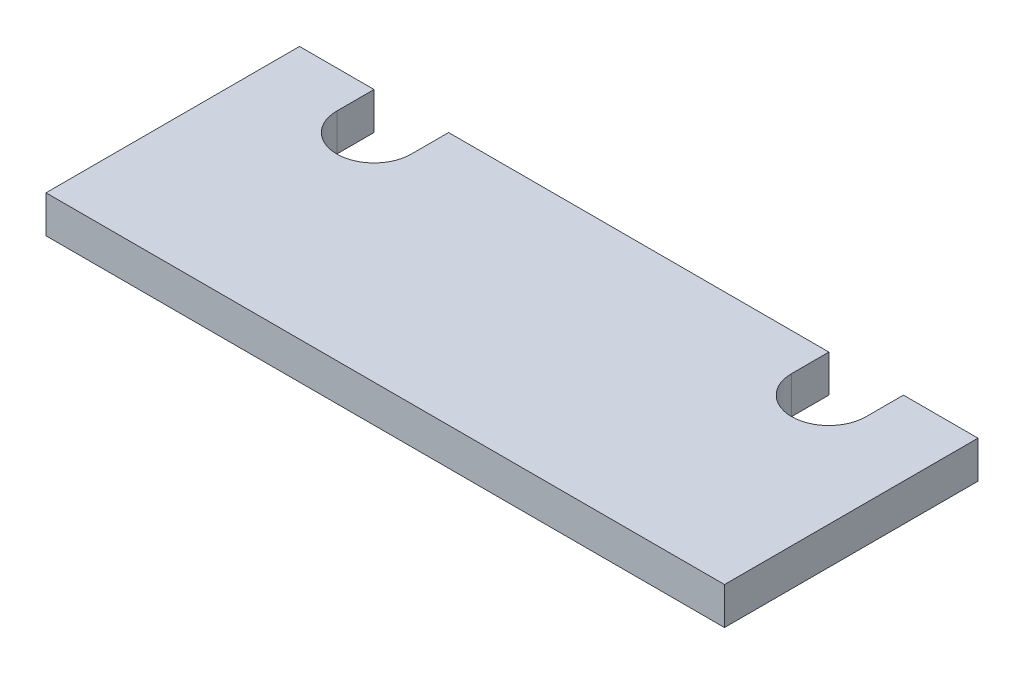
ISO-10303-21;
HEADER;
FILE_DESCRIPTION(('STEP AP214'),'2;1');
FILE_NAME('part.step','',(''),(''),'','','');
FILE_SCHEMA(('AUTOMOTIVE_DESIGN { 1 0 10303 214 1 1 1 1 }'));
ENDSEC;
DATA;
#1=APPLICATION_CONTEXT('core data for automotive mechanical design processes');
#2=APPLICATION_PROTOCOL_DEFINITION('international standard','automotive_design',2000,#1);
#3=PRODUCT_CONTEXT('',#1,'mechanical');
#4=PRODUCT('Part','Part','',(#3));
#5=PRODUCT_RELATED_PRODUCT_CATEGORY('part','',(#4));
#6=PRODUCT_DEFINITION_FORMATION('','',#4);
#7=PRODUCT_DEFINITION_CONTEXT('part definition',#1,'design');
#8=PRODUCT_DEFINITION('design','',#6,#7);
#9=PRODUCT_DEFINITION_SHAPE('','',#8);
#10=(LENGTH_UNIT() NAMED_UNIT(*) SI_UNIT(.MILLI.,.METRE.));
#11=(NAMED_UNIT(*) PLANE_ANGLE_UNIT() SI_UNIT($,.RADIAN.));
#12=(NAMED_UNIT(*) SI_UNIT($,.STERADIAN.) SOLID_ANGLE_UNIT());
#13=UNCERTAINTY_MEASURE_WITH_UNIT(LENGTH_MEASURE(1.E-05),#10,'distance_accuracy_value','');
#14=(GEOMETRIC_REPRESENTATION_CONTEXT(3) GLOBAL_UNCERTAINTY_ASSIGNED_CONTEXT((#13)) GLOBAL_UNIT_ASSIGNED_CONTEXT((#10,
#11,#12)) REPRESENTATION_CONTEXT('',''));
#15=CARTESIAN_POINT('',(0.,0.,0.));
#16=DIRECTION('',(0.,0.,1.));
#17=DIRECTION('',(1.,0.,0.));
#18=AXIS2_PLACEMENT_3D('',#15,#16,#17);
#19=CARTESIAN_POINT('',(0.,6.35,-43.18));
#20=DIRECTION('',(0.,0.,1.));
#21=DIRECTION('',(1.,0.,0.));
#22=AXIS2_PLACEMENT_3D('',#19,#20,#21);
#23=PLANE('',#22);
#24=DIRECTION('',(-1.,0.,0.));
#25=VECTOR('',#24,1.);
#26=CARTESIAN_POINT('',(0.,6.35,-43.18));
#27=LINE('',#26,#25);
#28=CARTESIAN_POINT('',(90.17,6.35,-43.18));
#29=VERTEX_POINT('',#28);
#30=CARTESIAN_POINT('',(25.4,6.35,-43.18));
#31=VERTEX_POINT('',#30);
#32=EDGE_CURVE('E192',#29,#31,#27,.T.);
#33=ORIENTED_EDGE('',*,*,#32,.F.);
#34=DIRECTION('',(0.,-1.,0.));
#35=VECTOR('',#34,1.);
#36=CARTESIAN_POINT('',(90.17,6.35,-43.18));
#37=LINE('',#36,#35);
#38=CARTESIAN_POINT('',(90.17,0.,-43.18));
#39=VERTEX_POINT('',#38);
#40=EDGE_CURVE('E152',#29,#39,#37,.T.);
#41=ORIENTED_EDGE('',*,*,#40,.T.);
#42=DIRECTION('',(-1.,0.,0.));
#43=VECTOR('',#42,1.);
#44=CARTESIAN_POINT('',(0.,0.,-43.18));
#45=LINE('',#44,#43);
#46=CARTESIAN_POINT('',(25.4,0.,-43.18));
#47=VERTEX_POINT('',#46);
#48=EDGE_CURVE('E57',#39,#47,#45,.T.);
#49=ORIENTED_EDGE('',*,*,#48,.T.);
#50=DIRECTION('',(0.,1.,0.));
#51=VECTOR('',#50,1.);
#52=CARTESIAN_POINT('',(25.4,6.35,-43.18));
#53=LINE('',#52,#51);
#54=EDGE_CURVE('E172',#47,#31,#53,.T.);
#55=ORIENTED_EDGE('',*,*,#54,.T.);
#56=EDGE_LOOP('',(#33,#41,#49,#55));
#57=FACE_BOUND('',#56,.T.);
#58=ADVANCED_FACE('F34',(#57),#23,.F.);
#59=CARTESIAN_POINT('',(12.7,6.35,-43.18));
#60=VERTEX_POINT('',#59);
#61=CARTESIAN_POINT('',(0.,6.35,-43.18));
#62=VERTEX_POINT('',#61);
#63=EDGE_CURVE('E187',#60,#62,#27,.T.);
#64=ORIENTED_EDGE('',*,*,#63,.F.);
#65=DIRECTION('',(0.,-1.,0.));
#66=VECTOR('',#65,1.);
#67=CARTESIAN_POINT('',(12.7,6.35,-43.18));
#68=LINE('',#67,#66);
#69=CARTESIAN_POINT('',(12.7,0.,-43.18));
#70=VERTEX_POINT('',#69);
#71=EDGE_CURVE('E175',#60,#70,#68,.T.);
#72=ORIENTED_EDGE('',*,*,#71,.T.);
#73=CARTESIAN_POINT('',(0.,0.,-43.18));
#74=VERTEX_POINT('',#73);
#75=EDGE_CURVE('E199',#70,#74,#45,.T.);
#76=ORIENTED_EDGE('',*,*,#75,.T.);
#77=DIRECTION('',(0.,-1.,0.));
#78=VECTOR('',#77,1.);
#79=CARTESIAN_POINT('',(0.,6.35,-43.18));
#80=LINE('',#79,#78);
#81=EDGE_CURVE('E191',#62,#74,#80,.T.);
#82=ORIENTED_EDGE('',*,*,#81,.F.);
#83=EDGE_LOOP('',(#64,#72,#76,#82));
#84=FACE_BOUND('',#83,.T.);
#85=ADVANCED_FACE('F219',(#84),#23,.F.);
#86=CARTESIAN_POINT('',(0.,6.35,0.));
#87=DIRECTION('',(1.,0.,0.));
#88=DIRECTION('',(0.,0.,-1.));
#89=AXIS2_PLACEMENT_3D('',#86,#87,#88);
#90=PLANE('',#89);
#91=DIRECTION('',(0.,0.,1.));
#92=VECTOR('',#91,1.);
#93=CARTESIAN_POINT('',(0.,0.,0.));
#94=LINE('',#93,#92);
#95=CARTESIAN_POINT('',(0.,0.,0.));
#96=VERTEX_POINT('',#95);
#97=EDGE_CURVE('E178',#74,#96,#94,.T.);
#98=ORIENTED_EDGE('',*,*,#97,.T.);
#99=DIRECTION('',(0.,-1.,0.));
#100=VECTOR('',#99,1.);
#101=CARTESIAN_POINT('',(0.,6.35,0.));
#102=LINE('',#101,#100);
#103=CARTESIAN_POINT('',(0.,6.35,0.));
#104=VERTEX_POINT('',#103);
#105=EDGE_CURVE('E209',#104,#96,#102,.T.);
#106=ORIENTED_EDGE('',*,*,#105,.F.);
#107=DIRECTION('',(0.,0.,1.));
#108=VECTOR('',#107,1.);
#109=CARTESIAN_POINT('',(0.,6.35,0.));
#110=LINE('',#109,#108);
#111=EDGE_CURVE('E179',#62,#104,#110,.T.);
#112=ORIENTED_EDGE('',*,*,#111,.F.);
#113=ORIENTED_EDGE('',*,*,#81,.T.);
#114=EDGE_LOOP('',(#98,#106,#112,#113));
#115=FACE_BOUND('',#114,.T.);
#116=ADVANCED_FACE('F36',(#115),#90,.F.);
#117=CARTESIAN_POINT('',(0.,6.35,0.));
#118=DIRECTION('',(0.,0.,-1.));
#119=DIRECTION('',(-1.,0.,0.));
#120=AXIS2_PLACEMENT_3D('',#117,#118,#119);
#121=PLANE('',#120);
#122=DIRECTION('',(1.,0.,0.));
#123=VECTOR('',#122,1.);
#124=CARTESIAN_POINT('',(0.,0.,0.));
#125=LINE('',#124,#123);
#126=CARTESIAN_POINT('',(115.57,0.,0.));
#127=VERTEX_POINT('',#126);
#128=EDGE_CURVE('E195',#96,#127,#125,.T.);
#129=ORIENTED_EDGE('',*,*,#128,.T.);
#130=DIRECTION('',(0.,-1.,0.));
#131=VECTOR('',#130,1.);
#132=CARTESIAN_POINT('',(115.57,6.35,0.));
#133=LINE('',#132,#131);
#134=CARTESIAN_POINT('',(115.57,6.35,0.));
#135=VERTEX_POINT('',#134);
#136=EDGE_CURVE('E206',#135,#127,#133,.T.);
#137=ORIENTED_EDGE('',*,*,#136,.F.);
#138=DIRECTION('',(1.,0.,0.));
#139=VECTOR('',#138,1.);
#140=CARTESIAN_POINT('',(0.,6.35,0.));
#141=LINE('',#140,#139);
#142=EDGE_CURVE('E182',#104,#135,#141,.T.);
#143=ORIENTED_EDGE('',*,*,#142,.F.);
#144=ORIENTED_EDGE('',*,*,#105,.T.);
#145=EDGE_LOOP('',(#129,#137,#143,#144));
#146=FACE_BOUND('',#145,.T.);
#147=ADVANCED_FACE('F252',(#146),#121,.F.);
#148=CARTESIAN_POINT('',(115.57,6.35,0.));
#149=DIRECTION('',(-1.,0.,0.));
#150=DIRECTION('',(0.,0.,1.));
#151=AXIS2_PLACEMENT_3D('',#148,#149,#150);
#152=PLANE('',#151);
#153=DIRECTION('',(0.,0.,-1.));
#154=VECTOR('',#153,1.);
#155=CARTESIAN_POINT('',(115.57,0.,0.));
#156=LINE('',#155,#154);
#157=CARTESIAN_POINT('',(115.57,0.,-43.18));
#158=VERTEX_POINT('',#157);
#159=EDGE_CURVE('E197',#127,#158,#156,.T.);
#160=ORIENTED_EDGE('',*,*,#159,.T.);
#161=DIRECTION('',(0.,-1.,0.));
#162=VECTOR('',#161,1.);
#163=CARTESIAN_POINT('',(115.57,6.35,-43.18));
#164=LINE('',#163,#162);
#165=CARTESIAN_POINT('',(115.57,6.35,-43.18));
#166=VERTEX_POINT('',#165);
#167=EDGE_CURVE('E203',#166,#158,#164,.T.);
#168=ORIENTED_EDGE('',*,*,#167,.F.);
#169=DIRECTION('',(0.,0.,-1.));
#170=VECTOR('',#169,1.);
#171=CARTESIAN_POINT('',(115.57,6.35,0.));
#172=LINE('',#171,#170);
#173=EDGE_CURVE('E185',#135,#166,#172,.T.);
#174=ORIENTED_EDGE('',*,*,#173,.F.);
#175=ORIENTED_EDGE('',*,*,#136,.T.);
#176=EDGE_LOOP('',(#160,#168,#174,#175));
#177=FACE_BOUND('',#176,.T.);
#178=ADVANCED_FACE('F245',(#177),#152,.F.);
#179=CARTESIAN_POINT('',(102.87,0.,-43.18));
#180=VERTEX_POINT('',#179);
#181=EDGE_CURVE('E183',#158,#180,#45,.T.);
#182=ORIENTED_EDGE('',*,*,#181,.T.);
#183=DIRECTION('',(0.,1.,0.));
#184=VECTOR('',#183,1.);
#185=CARTESIAN_POINT('',(102.87,6.35,-43.18));
#186=LINE('',#185,#184);
#187=CARTESIAN_POINT('',(102.87,6.35,-43.18));
#188=VERTEX_POINT('',#187);
#189=EDGE_CURVE('E49',#180,#188,#186,.T.);
#190=ORIENTED_EDGE('',*,*,#189,.T.);
#191=EDGE_CURVE('E188',#166,#188,#27,.T.);
#192=ORIENTED_EDGE('',*,*,#191,.F.);
#193=ORIENTED_EDGE('',*,*,#167,.T.);
#194=EDGE_LOOP('',(#182,#190,#192,#193));
#195=FACE_BOUND('',#194,.T.);
#196=ADVANCED_FACE('F238',(#195),#23,.F.);
#197=CARTESIAN_POINT('',(0.,6.35,0.));
#198=DIRECTION('',(0.,-1.,0.));
#199=DIRECTION('',(0.,0.,-1.));
#200=AXIS2_PLACEMENT_3D('',#197,#198,#199);
#201=PLANE('',#200);
#202=CARTESIAN_POINT('',(96.52,6.35,-36.83));
#203=DIRECTION('',(0.,1.,0.));
#204=DIRECTION('',(0.,0.,-1.));
#205=AXIS2_PLACEMENT_3D('',#202,#203,#204);
#206=CIRCLE('',#205,6.35);
#207=CARTESIAN_POINT('',(90.17,6.35,-36.83));
#208=VERTEX_POINT('',#207);
#209=CARTESIAN_POINT('',(102.87,6.35,-36.83));
#210=VERTEX_POINT('',#209);
#211=EDGE_CURVE('E132',#208,#210,#206,.T.);
#212=ORIENTED_EDGE('',*,*,#211,.F.);
#213=DIRECTION('',(0.,0.,1.));
#214=VECTOR('',#213,1.);
#215=CARTESIAN_POINT('',(90.17,6.35,-52.705));
#216=LINE('',#215,#214);
#217=EDGE_CURVE('E143',#29,#208,#216,.T.);
#218=ORIENTED_EDGE('',*,*,#217,.F.);
#219=ORIENTED_EDGE('',*,*,#32,.T.);
#220=DIRECTION('',(0.,0.,-1.));
#221=VECTOR('',#220,1.);
#222=CARTESIAN_POINT('',(25.4,6.35,-52.705));
#223=LINE('',#222,#221);
#224=CARTESIAN_POINT('',(25.4,6.35,-36.83));
#225=VERTEX_POINT('',#224);
#226=EDGE_CURVE('E165',#225,#31,#223,.T.);
#227=ORIENTED_EDGE('',*,*,#226,.F.);
#228=CARTESIAN_POINT('',(19.05,6.35,-36.83));
#229=DIRECTION('',(0.,1.,0.));
#230=DIRECTION('',(0.,0.,1.));
#231=AXIS2_PLACEMENT_3D('',#228,#229,#230);
#232=CIRCLE('',#231,6.35);
#233=CARTESIAN_POINT('',(12.7,6.35,-36.83));
#234=VERTEX_POINT('',#233);
#235=EDGE_CURVE('E154',#234,#225,#232,.T.);
#236=ORIENTED_EDGE('',*,*,#235,.F.);
#237=DIRECTION('',(0.,0.,1.));
#238=VECTOR('',#237,1.);
#239=CARTESIAN_POINT('',(12.7,6.35,-52.705));
#240=LINE('',#239,#238);
#241=EDGE_CURVE('E159',#60,#234,#240,.T.);
#242=ORIENTED_EDGE('',*,*,#241,.F.);
#243=ORIENTED_EDGE('',*,*,#63,.T.);
#244=ORIENTED_EDGE('',*,*,#111,.T.);
#245=ORIENTED_EDGE('',*,*,#142,.T.);
#246=ORIENTED_EDGE('',*,*,#173,.T.);
#247=ORIENTED_EDGE('',*,*,#191,.T.);
#248=DIRECTION('',(0.,0.,-1.));
#249=VECTOR('',#248,1.);
#250=CARTESIAN_POINT('',(102.87,6.35,-52.705));
#251=LINE('',#250,#249);
#252=EDGE_CURVE('E145',#210,#188,#251,.T.);
#253=ORIENTED_EDGE('',*,*,#252,.F.);
#254=EDGE_LOOP('',(#212,#218,#219,#227,#236,#242,#243,#244,#245,#246,#247,#253));
#255=FACE_BOUND('',#254,.T.);
#256=ADVANCED_FACE('F227',(#255),#201,.F.);
#257=CARTESIAN_POINT('',(0.,0.,0.));
#258=DIRECTION('',(0.,-1.,0.));
#259=DIRECTION('',(0.,0.,-1.));
#260=AXIS2_PLACEMENT_3D('',#257,#258,#259);
#261=PLANE('',#260);
#262=DIRECTION('',(0.,0.,-1.));
#263=VECTOR('',#262,1.);
#264=CARTESIAN_POINT('',(90.1700000000001,0.,-1.57651669496772E-13));
#265=LINE('',#264,#263);
#266=CARTESIAN_POINT('',(90.17,0.,-36.83));
#267=VERTEX_POINT('',#266);
#268=EDGE_CURVE('E11',#267,#39,#265,.T.);
#269=ORIENTED_EDGE('',*,*,#268,.F.);
#270=CARTESIAN_POINT('',(96.52,0.,-36.83));
#271=DIRECTION('',(0.,1.,0.));
#272=DIRECTION('',(0.,0.,-1.));
#273=AXIS2_PLACEMENT_3D('',#270,#271,#272);
#274=CIRCLE('',#273,6.35);
#275=CARTESIAN_POINT('',(102.87,0.,-36.83));
#276=VERTEX_POINT('',#275);
#277=EDGE_CURVE('E129',#267,#276,#274,.T.);
#278=ORIENTED_EDGE('',*,*,#277,.T.);
#279=DIRECTION('',(0.,0.,-1.));
#280=VECTOR('',#279,1.);
#281=CARTESIAN_POINT('',(102.87,0.,-52.705));
#282=LINE('',#281,#280);
#283=EDGE_CURVE('E135',#276,#180,#282,.T.);
#284=ORIENTED_EDGE('',*,*,#283,.T.);
#285=ORIENTED_EDGE('',*,*,#181,.F.);
#286=ORIENTED_EDGE('',*,*,#159,.F.);
#287=ORIENTED_EDGE('',*,*,#128,.F.);
#288=ORIENTED_EDGE('',*,*,#97,.F.);
#289=ORIENTED_EDGE('',*,*,#75,.F.);
#290=DIRECTION('',(0.,0.,-1.));
#291=VECTOR('',#290,1.);
#292=CARTESIAN_POINT('',(12.7,0.,0.));
#293=LINE('',#292,#291);
#294=CARTESIAN_POINT('',(12.7,0.,-36.83));
#295=VERTEX_POINT('',#294);
#296=EDGE_CURVE('E42',#295,#70,#293,.T.);
#297=ORIENTED_EDGE('',*,*,#296,.F.);
#298=CARTESIAN_POINT('',(19.05,0.,-36.83));
#299=DIRECTION('',(0.,1.,0.));
#300=DIRECTION('',(0.,0.,1.));
#301=AXIS2_PLACEMENT_3D('',#298,#299,#300);
#302=CIRCLE('',#301,6.35);
#303=CARTESIAN_POINT('',(25.4,0.,-36.83));
#304=VERTEX_POINT('',#303);
#305=EDGE_CURVE('E155',#295,#304,#302,.T.);
#306=ORIENTED_EDGE('',*,*,#305,.T.);
#307=DIRECTION('',(0.,0.,-1.));
#308=VECTOR('',#307,1.);
#309=CARTESIAN_POINT('',(25.4,0.,-52.705));
#310=LINE('',#309,#308);
#311=EDGE_CURVE('E158',#304,#47,#310,.T.);
#312=ORIENTED_EDGE('',*,*,#311,.T.);
#313=ORIENTED_EDGE('',*,*,#48,.F.);
#314=EDGE_LOOP('',(#269,#278,#284,#285,#286,#287,#288,#289,#297,#306,#312,#313));
#315=FACE_BOUND('',#314,.T.);
#316=ADVANCED_FACE('F142',(#315),#261,.T.);
#317=CARTESIAN_POINT('',(12.7,0.,-52.705));
#318=DIRECTION('',(-1.,0.,0.));
#319=DIRECTION('',(0.,0.,1.));
#320=AXIS2_PLACEMENT_3D('',#317,#318,#319);
#321=PLANE('',#320);
#322=ORIENTED_EDGE('',*,*,#241,.T.);
#323=DIRECTION('',(0.,1.,0.));
#324=VECTOR('',#323,1.);
#325=CARTESIAN_POINT('',(12.7,0.,-36.83));
#326=LINE('',#325,#324);
#327=EDGE_CURVE('E169',#295,#234,#326,.T.);
#328=ORIENTED_EDGE('',*,*,#327,.F.);
#329=ORIENTED_EDGE('',*,*,#296,.T.);
#330=ORIENTED_EDGE('',*,*,#71,.F.);
#331=EDGE_LOOP('',(#322,#328,#329,#330));
#332=FACE_BOUND('',#331,.T.);
#333=ADVANCED_FACE('F213',(#332),#321,.F.);
#334=CARTESIAN_POINT('',(25.4,0.,-52.705));
#335=DIRECTION('',(1.,0.,0.));
#336=DIRECTION('',(0.,0.,-1.));
#337=AXIS2_PLACEMENT_3D('',#334,#335,#336);
#338=PLANE('',#337);
#339=ORIENTED_EDGE('',*,*,#311,.F.);
#340=DIRECTION('',(0.,1.,0.));
#341=VECTOR('',#340,1.);
#342=CARTESIAN_POINT('',(25.4,0.,-36.83));
#343=LINE('',#342,#341);
#344=EDGE_CURVE('E162',#304,#225,#343,.T.);
#345=ORIENTED_EDGE('',*,*,#344,.T.);
#346=ORIENTED_EDGE('',*,*,#226,.T.);
#347=ORIENTED_EDGE('',*,*,#54,.F.);
#348=EDGE_LOOP('',(#339,#345,#346,#347));
#349=FACE_BOUND('',#348,.T.);
#350=ADVANCED_FACE('F235',(#349),#338,.F.);
#351=CARTESIAN_POINT('',(19.05,0.,-36.83));
#352=DIRECTION('',(0.,1.,0.));
#353=DIRECTION('',(0.,0.,1.));
#354=AXIS2_PLACEMENT_3D('',#351,#352,#353);
#355=CYLINDRICAL_SURFACE('',#354,6.35);
#356=ORIENTED_EDGE('',*,*,#235,.T.);
#357=ORIENTED_EDGE('',*,*,#344,.F.);
#358=ORIENTED_EDGE('',*,*,#305,.F.);
#359=ORIENTED_EDGE('',*,*,#327,.T.);
#360=EDGE_LOOP('',(#356,#357,#358,#359));
#361=FACE_BOUND('',#360,.T.);
#362=ADVANCED_FACE('F310',(#361),#355,.F.);
#363=CARTESIAN_POINT('',(90.17,0.,-52.705));
#364=DIRECTION('',(-1.,0.,0.));
#365=DIRECTION('',(0.,0.,1.));
#366=AXIS2_PLACEMENT_3D('',#363,#364,#365);
#367=PLANE('',#366);
#368=ORIENTED_EDGE('',*,*,#217,.T.);
#369=DIRECTION('',(0.,1.,0.));
#370=VECTOR('',#369,1.);
#371=CARTESIAN_POINT('',(90.17,0.,-36.83));
#372=LINE('',#371,#370);
#373=EDGE_CURVE('E134',#267,#208,#372,.T.);
#374=ORIENTED_EDGE('',*,*,#373,.F.);
#375=ORIENTED_EDGE('',*,*,#268,.T.);
#376=ORIENTED_EDGE('',*,*,#40,.F.);
#377=EDGE_LOOP('',(#368,#374,#375,#376));
#378=FACE_BOUND('',#377,.T.);
#379=ADVANCED_FACE('F319',(#378),#367,.F.);
#380=CARTESIAN_POINT('',(102.87,0.,-52.705));
#381=DIRECTION('',(1.,0.,0.));
#382=DIRECTION('',(0.,0.,-1.));
#383=AXIS2_PLACEMENT_3D('',#380,#381,#382);
#384=PLANE('',#383);
#385=ORIENTED_EDGE('',*,*,#283,.F.);
#386=DIRECTION('',(0.,1.,0.));
#387=VECTOR('',#386,1.);
#388=CARTESIAN_POINT('',(102.87,0.,-36.83));
#389=LINE('',#388,#387);
#390=EDGE_CURVE('E125',#276,#210,#389,.T.);
#391=ORIENTED_EDGE('',*,*,#390,.T.);
#392=ORIENTED_EDGE('',*,*,#252,.T.);
#393=ORIENTED_EDGE('',*,*,#189,.F.);
#394=EDGE_LOOP('',(#385,#391,#392,#393));
#395=FACE_BOUND('',#394,.T.);
#396=ADVANCED_FACE('F137',(#395),#384,.F.);
#397=CARTESIAN_POINT('',(96.52,0.,-36.83));
#398=DIRECTION('',(0.,1.,0.));
#399=DIRECTION('',(0.,0.,1.));
#400=AXIS2_PLACEMENT_3D('',#397,#398,#399);
#401=CYLINDRICAL_SURFACE('',#400,6.35);
#402=ORIENTED_EDGE('',*,*,#211,.T.);
#403=ORIENTED_EDGE('',*,*,#390,.F.);
#404=ORIENTED_EDGE('',*,*,#277,.F.);
#405=ORIENTED_EDGE('',*,*,#373,.T.);
#406=EDGE_LOOP('',(#402,#403,#404,#405));
#407=FACE_BOUND('',#406,.T.);
#408=ADVANCED_FACE('F126',(#407),#401,.F.);
#409=CLOSED_SHELL('',(#58,#85,#116,#147,#178,#196,#256,#316,#333,#350,#362,#379,#396,#408));
#410=MANIFOLD_SOLID_BREP('B2',#409);
#411=ADVANCED_BREP_SHAPE_REPRESENTATION('',(#18,#410),#14);
#412=SHAPE_DEFINITION_REPRESENTATION(#9,#411);
ENDSEC;
END-ISO-10303-21;
